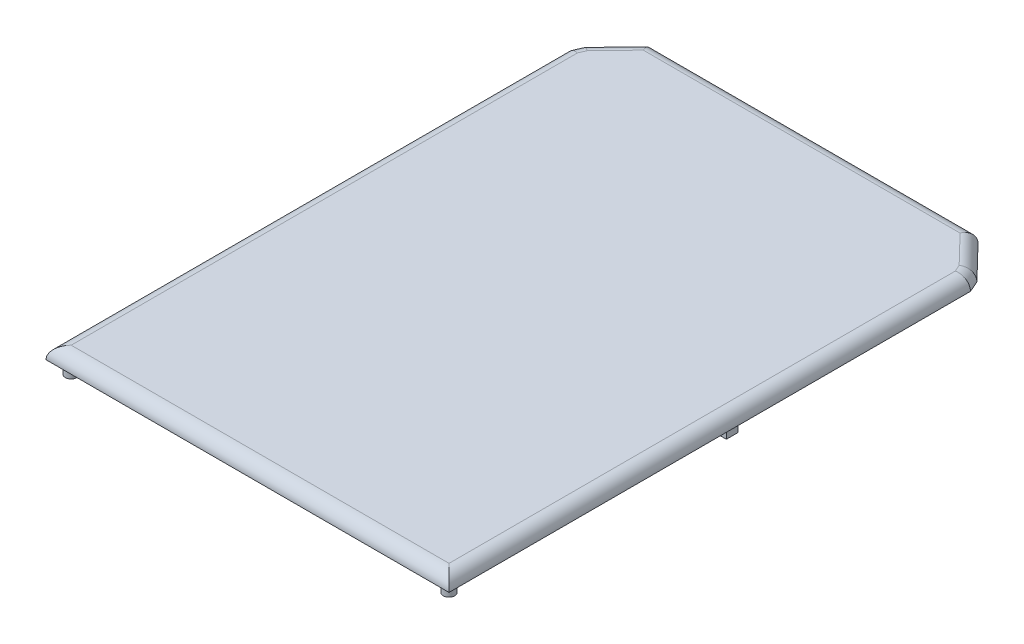
ISO-10303-21;
HEADER;
FILE_DESCRIPTION(('STEP AP214'),'2;1');
FILE_NAME('part.step','',(''),(''),'','','');
FILE_SCHEMA(('AUTOMOTIVE_DESIGN { 1 0 10303 214 1 1 1 1 }'));
ENDSEC;
DATA;
#1=APPLICATION_CONTEXT('core data for automotive mechanical design processes');
#2=APPLICATION_PROTOCOL_DEFINITION('international standard','automotive_design',2000,#1);
#3=PRODUCT_CONTEXT('',#1,'mechanical');
#4=PRODUCT('Part','Part','',(#3));
#5=PRODUCT_RELATED_PRODUCT_CATEGORY('part','',(#4));
#6=PRODUCT_DEFINITION_FORMATION('','',#4);
#7=PRODUCT_DEFINITION_CONTEXT('part definition',#1,'design');
#8=PRODUCT_DEFINITION('design','',#6,#7);
#9=PRODUCT_DEFINITION_SHAPE('','',#8);
#10=(LENGTH_UNIT() NAMED_UNIT(*) SI_UNIT(.MILLI.,.METRE.));
#11=(NAMED_UNIT(*) PLANE_ANGLE_UNIT() SI_UNIT($,.RADIAN.));
#12=(NAMED_UNIT(*) SI_UNIT($,.STERADIAN.) SOLID_ANGLE_UNIT());
#13=UNCERTAINTY_MEASURE_WITH_UNIT(LENGTH_MEASURE(1.E-05),#10,'distance_accuracy_value','');
#14=(GEOMETRIC_REPRESENTATION_CONTEXT(3) GLOBAL_UNCERTAINTY_ASSIGNED_CONTEXT((#13)) GLOBAL_UNIT_ASSIGNED_CONTEXT((#10,
#11,#12)) REPRESENTATION_CONTEXT('',''));
#15=CARTESIAN_POINT('',(0.,0.,0.));
#16=DIRECTION('',(0.,0.,1.));
#17=DIRECTION('',(1.,0.,0.));
#18=AXIS2_PLACEMENT_3D('',#15,#16,#17);
#19=CARTESIAN_POINT('',(0.,5.,0.));
#20=DIRECTION('',(0.,1.,0.));
#21=DIRECTION('',(0.,0.,1.));
#22=AXIS2_PLACEMENT_3D('',#19,#20,#21);
#23=PLANE('',#22);
#24=DIRECTION('',(-0.397835276280769,0.,0.917456861627076));
#25=VECTOR('',#24,1.);
#26=CARTESIAN_POINT('',(-75.4127156918646,5.,-30.0208236185962));
#27=LINE('',#26,#25);
#28=CARTESIAN_POINT('',(-73.8147089567304,5.,-33.7060228241099));
#29=VERTEX_POINT('',#28);
#30=CARTESIAN_POINT('',(-75.,5.,-30.9725965406513));
#31=VERTEX_POINT('',#30);
#32=EDGE_CURVE('E276',#29,#31,#27,.T.);
#33=ORIENTED_EDGE('',*,*,#32,.T.);
#34=DIRECTION('',(0.,0.,1.));
#35=VECTOR('',#34,1.);
#36=CARTESIAN_POINT('',(-75.,5.,175.));
#37=LINE('',#36,#35);
#38=CARTESIAN_POINT('',(-75.,5.,170.));
#39=VERTEX_POINT('',#38);
#40=EDGE_CURVE('E11',#31,#39,#37,.T.);
#41=ORIENTED_EDGE('',*,*,#40,.T.);
#42=DIRECTION('',(1.,0.,0.));
#43=VECTOR('',#42,1.);
#44=CARTESIAN_POINT('',(80.,5.,170.));
#45=LINE('',#44,#43);
#46=CARTESIAN_POINT('',(75.,5.,170.));
#47=VERTEX_POINT('',#46);
#48=EDGE_CURVE('E44',#39,#47,#45,.T.);
#49=ORIENTED_EDGE('',*,*,#48,.T.);
#50=DIRECTION('',(0.,0.,-1.));
#51=VECTOR('',#50,1.);
#52=CARTESIAN_POINT('',(75.,5.,-32.01));
#53=LINE('',#52,#51);
#54=CARTESIAN_POINT('',(75.,5.,-30.9725965406513));
#55=VERTEX_POINT('',#54);
#56=EDGE_CURVE('E266',#47,#55,#53,.T.);
#57=ORIENTED_EDGE('',*,*,#56,.T.);
#58=DIRECTION('',(-0.397835276280769,0.,-0.917456861627076));
#59=VECTOR('',#58,1.);
#60=CARTESIAN_POINT('',(73.4527156918646,5.,-34.5408236185962));
#61=LINE('',#60,#59);
#62=CARTESIAN_POINT('',(73.8147089567303,5.,-33.7060228241099));
#63=VERTEX_POINT('',#62);
#64=EDGE_CURVE('E268',#55,#63,#61,.T.);
#65=ORIENTED_EDGE('',*,*,#64,.T.);
#66=DIRECTION('',(-0.695545808825703,0.,-0.718481751908146));
#67=VECTOR('',#66,1.);
#68=CARTESIAN_POINT('',(61.4075912404593,5.,-46.5222709558715));
#69=LINE('',#68,#67);
#70=CARTESIAN_POINT('',(62.8812670581701,5.,-45.));
#71=VERTEX_POINT('',#70);
#72=EDGE_CURVE('E270',#63,#71,#69,.T.);
#73=ORIENTED_EDGE('',*,*,#72,.T.);
#74=DIRECTION('',(-1.,0.,0.));
#75=VECTOR('',#74,1.);
#76=CARTESIAN_POINT('',(-65.,5.,-45.));
#77=LINE('',#76,#75);
#78=CARTESIAN_POINT('',(-62.88126705817,5.,-45.));
#79=VERTEX_POINT('',#78);
#80=EDGE_CURVE('E272',#71,#79,#77,.T.);
#81=ORIENTED_EDGE('',*,*,#80,.T.);
#82=DIRECTION('',(-0.695545808825703,0.,0.718481751908146));
#83=VECTOR('',#82,1.);
#84=CARTESIAN_POINT('',(-74.4475912404593,5.,-33.0522709558715));
#85=LINE('',#84,#83);
#86=EDGE_CURVE('E274',#79,#29,#85,.T.);
#87=ORIENTED_EDGE('',*,*,#86,.T.);
#88=EDGE_LOOP('',(#33,#41,#49,#57,#65,#73,#81,#87));
#89=FACE_BOUND('',#88,.T.);
#90=ADVANCED_FACE('F35',(#89),#23,.T.);
#91=CARTESIAN_POINT('',(0.,0.,0.));
#92=DIRECTION('',(0.,1.,0.));
#93=DIRECTION('',(0.,0.,1.));
#94=AXIS2_PLACEMENT_3D('',#91,#92,#93);
#95=PLANE('',#94);
#96=DIRECTION('',(0.,0.,-1.));
#97=VECTOR('',#96,1.);
#98=CARTESIAN_POINT('',(77.4,0.,57.7));
#99=LINE('',#98,#97);
#100=CARTESIAN_POINT('',(77.4,0.,62.3));
#101=VERTEX_POINT('',#100);
#102=CARTESIAN_POINT('',(77.4,0.,57.7));
#103=VERTEX_POINT('',#102);
#104=EDGE_CURVE('E179',#101,#103,#99,.T.);
#105=ORIENTED_EDGE('',*,*,#104,.T.);
#106=DIRECTION('',(-1.,0.,0.));
#107=VECTOR('',#106,1.);
#108=CARTESIAN_POINT('',(75.1,0.,57.7));
#109=LINE('',#108,#107);
#110=CARTESIAN_POINT('',(75.1,0.,57.7));
#111=VERTEX_POINT('',#110);
#112=EDGE_CURVE('E161',#103,#111,#109,.T.);
#113=ORIENTED_EDGE('',*,*,#112,.T.);
#114=DIRECTION('',(0.,0.,1.));
#115=VECTOR('',#114,1.);
#116=CARTESIAN_POINT('',(75.1,0.,62.3));
#117=LINE('',#116,#115);
#118=CARTESIAN_POINT('',(75.1,0.,62.3));
#119=VERTEX_POINT('',#118);
#120=EDGE_CURVE('E176',#111,#119,#117,.T.);
#121=ORIENTED_EDGE('',*,*,#120,.T.);
#122=DIRECTION('',(1.,0.,0.));
#123=VECTOR('',#122,1.);
#124=CARTESIAN_POINT('',(77.4,0.,62.3));
#125=LINE('',#124,#123);
#126=EDGE_CURVE('E52',#119,#101,#125,.T.);
#127=ORIENTED_EDGE('',*,*,#126,.T.);
#128=EDGE_LOOP('',(#105,#113,#121,#127));
#129=FACE_BOUND('',#128,.T.);
#130=DIRECTION('',(0.,0.,-1.));
#131=VECTOR('',#130,1.);
#132=CARTESIAN_POINT('',(-75.1,0.,60.));
#133=LINE('',#132,#131);
#134=CARTESIAN_POINT('',(-75.1,0.,62.3));
#135=VERTEX_POINT('',#134);
#136=CARTESIAN_POINT('',(-75.1,0.,57.7));
#137=VERTEX_POINT('',#136);
#138=EDGE_CURVE('E193',#135,#137,#133,.T.);
#139=ORIENTED_EDGE('',*,*,#138,.T.);
#140=DIRECTION('',(-1.,0.,0.));
#141=VECTOR('',#140,1.);
#142=CARTESIAN_POINT('',(-75.1,0.,57.7));
#143=LINE('',#142,#141);
#144=CARTESIAN_POINT('',(-77.4,0.,57.7));
#145=VERTEX_POINT('',#144);
#146=EDGE_CURVE('E185',#137,#145,#143,.T.);
#147=ORIENTED_EDGE('',*,*,#146,.T.);
#148=DIRECTION('',(0.,0.,1.));
#149=VECTOR('',#148,1.);
#150=CARTESIAN_POINT('',(-77.4,0.,57.7));
#151=LINE('',#150,#149);
#152=CARTESIAN_POINT('',(-77.4,0.,62.3));
#153=VERTEX_POINT('',#152);
#154=EDGE_CURVE('E204',#145,#153,#151,.T.);
#155=ORIENTED_EDGE('',*,*,#154,.T.);
#156=DIRECTION('',(1.,0.,0.));
#157=VECTOR('',#156,1.);
#158=CARTESIAN_POINT('',(-77.4,0.,62.3));
#159=LINE('',#158,#157);
#160=EDGE_CURVE('E60',#153,#135,#159,.T.);
#161=ORIENTED_EDGE('',*,*,#160,.T.);
#162=EDGE_LOOP('',(#139,#147,#155,#161));
#163=FACE_BOUND('',#162,.T.);
#164=CARTESIAN_POINT('',(-75.,0.,170.));
#165=DIRECTION('',(0.,1.,0.));
#166=DIRECTION('',(0.,0.,1.));
#167=AXIS2_PLACEMENT_3D('',#164,#165,#166);
#168=CIRCLE('',#167,2.29999999999999);
#169=CARTESIAN_POINT('',(-75.,0.,172.3));
#170=VERTEX_POINT('',#169);
#171=EDGE_CURVE('E212',#170,#170,#168,.T.);
#172=ORIENTED_EDGE('',*,*,#171,.T.);
#173=EDGE_LOOP('',(#172));
#174=FACE_BOUND('',#173,.T.);
#175=CARTESIAN_POINT('',(75.,0.,170.));
#176=DIRECTION('',(0.,1.,0.));
#177=DIRECTION('',(0.,0.,1.));
#178=AXIS2_PLACEMENT_3D('',#175,#176,#177);
#179=CIRCLE('',#178,2.29999999999999);
#180=CARTESIAN_POINT('',(75.,0.,172.3));
#181=VERTEX_POINT('',#180);
#182=EDGE_CURVE('E221',#181,#181,#179,.T.);
#183=ORIENTED_EDGE('',*,*,#182,.T.);
#184=EDGE_LOOP('',(#183));
#185=FACE_BOUND('',#184,.T.);
#186=CARTESIAN_POINT('',(62.5,0.,-40.));
#187=DIRECTION('',(0.,1.,0.));
#188=DIRECTION('',(0.,0.,1.));
#189=AXIS2_PLACEMENT_3D('',#186,#187,#188);
#190=CIRCLE('',#189,2.29999999999999);
#191=CARTESIAN_POINT('',(62.5,0.,-37.7));
#192=VERTEX_POINT('',#191);
#193=EDGE_CURVE('E227',#192,#192,#190,.T.);
#194=ORIENTED_EDGE('',*,*,#193,.T.);
#195=EDGE_LOOP('',(#194));
#196=FACE_BOUND('',#195,.T.);
#197=CARTESIAN_POINT('',(-62.5,0.,-40.));
#198=DIRECTION('',(0.,1.,0.));
#199=DIRECTION('',(0.,0.,1.));
#200=AXIS2_PLACEMENT_3D('',#197,#198,#199);
#201=CIRCLE('',#200,2.3);
#202=CARTESIAN_POINT('',(-62.5,0.,-37.7));
#203=VERTEX_POINT('',#202);
#204=EDGE_CURVE('E233',#203,#203,#201,.T.);
#205=ORIENTED_EDGE('',*,*,#204,.T.);
#206=EDGE_LOOP('',(#205));
#207=FACE_BOUND('',#206,.T.);
#208=DIRECTION('',(1.,0.,0.));
#209=VECTOR('',#208,1.);
#210=CARTESIAN_POINT('',(-80.,0.,175.));
#211=LINE('',#210,#209);
#212=CARTESIAN_POINT('',(-80.,0.,175.));
#213=VERTEX_POINT('',#212);
#214=CARTESIAN_POINT('',(80.,0.,175.));
#215=VERTEX_POINT('',#214);
#216=EDGE_CURVE('E242',#213,#215,#211,.T.);
#217=ORIENTED_EDGE('',*,*,#216,.F.);
#218=DIRECTION('',(0.,0.,1.));
#219=VECTOR('',#218,1.);
#220=CARTESIAN_POINT('',(-80.,0.,-30.));
#221=LINE('',#220,#219);
#222=CARTESIAN_POINT('',(-80.,0.,-32.01));
#223=VERTEX_POINT('',#222);
#224=EDGE_CURVE('E263',#223,#213,#221,.T.);
#225=ORIENTED_EDGE('',*,*,#224,.F.);
#226=DIRECTION('',(-0.397835276280769,0.,0.917456861627076));
#227=VECTOR('',#226,1.);
#228=CARTESIAN_POINT('',(-78.04,0.,-36.53));
#229=LINE('',#228,#227);
#230=CARTESIAN_POINT('',(-78.04,0.,-36.53));
#231=VERTEX_POINT('',#230);
#232=EDGE_CURVE('E260',#231,#223,#229,.T.);
#233=ORIENTED_EDGE('',*,*,#232,.F.);
#234=DIRECTION('',(-0.695545808825703,0.,0.718481751908146));
#235=VECTOR('',#234,1.);
#236=CARTESIAN_POINT('',(-65.,0.,-50.));
#237=LINE('',#236,#235);
#238=CARTESIAN_POINT('',(-65.,0.,-50.));
#239=VERTEX_POINT('',#238);
#240=EDGE_CURVE('E257',#239,#231,#237,.T.);
#241=ORIENTED_EDGE('',*,*,#240,.F.);
#242=DIRECTION('',(-1.,0.,0.));
#243=VECTOR('',#242,1.);
#244=CARTESIAN_POINT('',(65.,0.,-50.));
#245=LINE('',#244,#243);
#246=CARTESIAN_POINT('',(65.,0.,-50.));
#247=VERTEX_POINT('',#246);
#248=EDGE_CURVE('E254',#247,#239,#245,.T.);
#249=ORIENTED_EDGE('',*,*,#248,.F.);
#250=DIRECTION('',(-0.695545808825703,0.,-0.718481751908146));
#251=VECTOR('',#250,1.);
#252=CARTESIAN_POINT('',(78.04,0.,-36.53));
#253=LINE('',#252,#251);
#254=CARTESIAN_POINT('',(78.04,0.,-36.53));
#255=VERTEX_POINT('',#254);
#256=EDGE_CURVE('E251',#255,#247,#253,.T.);
#257=ORIENTED_EDGE('',*,*,#256,.F.);
#258=DIRECTION('',(-0.397835276280769,0.,-0.917456861627076));
#259=VECTOR('',#258,1.);
#260=CARTESIAN_POINT('',(80.,0.,-32.01));
#261=LINE('',#260,#259);
#262=CARTESIAN_POINT('',(80.,0.,-32.01));
#263=VERTEX_POINT('',#262);
#264=EDGE_CURVE('E248',#263,#255,#261,.T.);
#265=ORIENTED_EDGE('',*,*,#264,.F.);
#266=DIRECTION('',(0.,0.,-1.));
#267=VECTOR('',#266,1.);
#268=CARTESIAN_POINT('',(80.,0.,-30.));
#269=LINE('',#268,#267);
#270=EDGE_CURVE('E245',#215,#263,#269,.T.);
#271=ORIENTED_EDGE('',*,*,#270,.F.);
#272=EDGE_LOOP('',(#217,#225,#233,#241,#249,#257,#265,#271));
#273=FACE_BOUND('',#272,.T.);
#274=ADVANCED_FACE('F309',(#129,#163,#174,#185,#196,#207,#273),#95,.F.);
#275=CARTESIAN_POINT('',(0.,0.,-45.));
#276=DIRECTION('',(1.,0.,0.));
#277=DIRECTION('',(0.,0.,-1.));
#278=AXIS2_PLACEMENT_3D('',#275,#276,#277);
#279=CYLINDRICAL_SURFACE('',#278,5.);
#280=CARTESIAN_POINT('',(62.8812670581701,0.,-45.));
#281=DIRECTION('',(0.920745841376898,0.,0.390162909035634));
#282=DIRECTION('',(-0.390162909035634,0.,0.920745841376898));
#283=AXIS2_PLACEMENT_3D('',#280,#281,#282);
#284=ELLIPSE('',#283,5.43038021493849,5.);
#285=EDGE_CURVE('E294',#247,#71,#284,.T.);
#286=ORIENTED_EDGE('',*,*,#285,.F.);
#287=ORIENTED_EDGE('',*,*,#248,.T.);
#288=CARTESIAN_POINT('',(-62.88126705817,0.,-45.));
#289=DIRECTION('',(0.920745841376898,0.,-0.390162909035634));
#290=DIRECTION('',(0.390162909035634,0.,0.920745841376898));
#291=AXIS2_PLACEMENT_3D('',#288,#289,#290);
#292=ELLIPSE('',#291,5.43038021493849,5.);
#293=EDGE_CURVE('E39',#79,#239,#292,.F.);
#294=ORIENTED_EDGE('',*,*,#293,.F.);
#295=ORIENTED_EDGE('',*,*,#80,.F.);
#296=EDGE_LOOP('',(#286,#287,#294,#295));
#297=FACE_BOUND('',#296,.T.);
#298=ADVANCED_FACE('F37',(#297),#279,.T.);
#299=CARTESIAN_POINT('',(-54.9484816119572,0.,-53.1943726963564));
#300=DIRECTION('',(0.695545808825703,0.,-0.718481751908146));
#301=DIRECTION('',(-0.718481751908146,0.,-0.695545808825703));
#302=AXIS2_PLACEMENT_3D('',#299,#300,#301);
#303=CYLINDRICAL_SURFACE('',#302,5.);
#304=ORIENTED_EDGE('',*,*,#293,.T.);
#305=ORIENTED_EDGE('',*,*,#240,.T.);
#306=CARTESIAN_POINT('',(-73.8147089567304,0.,-33.7060228241099));
#307=DIRECTION('',(0.555669256742774,0.,-0.831403438236175));
#308=DIRECTION('',(0.831403438236175,0.,0.555669256742773));
#309=AXIS2_PLACEMENT_3D('',#306,#307,#308);
#310=ELLIPSE('',#309,5.08211879930833,5.);
#311=EDGE_CURVE('E292',#29,#231,#310,.F.);
#312=ORIENTED_EDGE('',*,*,#311,.F.);
#313=ORIENTED_EDGE('',*,*,#86,.F.);
#314=EDGE_LOOP('',(#304,#305,#312,#313));
#315=FACE_BOUND('',#314,.T.);
#316=ADVANCED_FACE('F303',(#315),#303,.T.);
#317=CARTESIAN_POINT('',(54.9484816119572,0.,-53.1943726963564));
#318=DIRECTION('',(0.695545808825703,0.,0.718481751908146));
#319=DIRECTION('',(0.718481751908146,0.,-0.695545808825703));
#320=AXIS2_PLACEMENT_3D('',#317,#318,#319);
#321=CYLINDRICAL_SURFACE('',#320,5.);
#322=ORIENTED_EDGE('',*,*,#285,.T.);
#323=ORIENTED_EDGE('',*,*,#72,.F.);
#324=CARTESIAN_POINT('',(73.8147089567303,0.,-33.7060228241099));
#325=DIRECTION('',(0.555669256742774,0.,0.831403438236175));
#326=DIRECTION('',(-0.831403438236175,0.,0.555669256742773));
#327=AXIS2_PLACEMENT_3D('',#324,#325,#326);
#328=ELLIPSE('',#327,5.08211879930833,5.);
#329=EDGE_CURVE('E289',#255,#63,#328,.T.);
#330=ORIENTED_EDGE('',*,*,#329,.F.);
#331=ORIENTED_EDGE('',*,*,#256,.T.);
#332=EDGE_LOOP('',(#322,#323,#330,#331));
#333=FACE_BOUND('',#332,.T.);
#334=ADVANCED_FACE('F322',(#333),#321,.T.);
#335=CARTESIAN_POINT('',(-74.4344276233082,0.,-32.2768756950629));
#336=DIRECTION('',(0.397835276280769,0.,-0.917456861627076));
#337=DIRECTION('',(-0.917456861627076,0.,-0.397835276280769));
#338=AXIS2_PLACEMENT_3D('',#335,#336,#337);
#339=CYLINDRICAL_SURFACE('',#338,5.);
#340=ORIENTED_EDGE('',*,*,#311,.T.);
#341=ORIENTED_EDGE('',*,*,#232,.T.);
#342=CARTESIAN_POINT('',(-75.,0.,-30.9725965406513));
#343=DIRECTION('',(0.203154052842816,0.,-0.979146787163977));
#344=DIRECTION('',(-0.979146787163977,0.,-0.203154052842816));
#345=AXIS2_PLACEMENT_3D('',#342,#343,#344);
#346=ELLIPSE('',#345,5.10648665301973,5.);
#347=EDGE_CURVE('E286',#31,#223,#346,.F.);
#348=ORIENTED_EDGE('',*,*,#347,.F.);
#349=ORIENTED_EDGE('',*,*,#32,.F.);
#350=EDGE_LOOP('',(#340,#341,#348,#349));
#351=FACE_BOUND('',#350,.T.);
#352=ADVANCED_FACE('F313',(#351),#339,.T.);
#353=CARTESIAN_POINT('',(74.4344276233082,0.,-32.2768756950629));
#354=DIRECTION('',(0.397835276280769,0.,0.917456861627076));
#355=DIRECTION('',(0.917456861627076,0.,-0.397835276280769));
#356=AXIS2_PLACEMENT_3D('',#353,#354,#355);
#357=CYLINDRICAL_SURFACE('',#356,5.);
#358=ORIENTED_EDGE('',*,*,#329,.T.);
#359=ORIENTED_EDGE('',*,*,#64,.F.);
#360=CARTESIAN_POINT('',(75.,0.,-30.9725965406513));
#361=DIRECTION('',(0.203154052842816,0.,0.979146787163977));
#362=DIRECTION('',(-0.979146787163977,0.,0.203154052842816));
#363=AXIS2_PLACEMENT_3D('',#360,#361,#362);
#364=ELLIPSE('',#363,5.10648665301973,5.);
#365=EDGE_CURVE('E283',#263,#55,#364,.T.);
#366=ORIENTED_EDGE('',*,*,#365,.F.);
#367=ORIENTED_EDGE('',*,*,#264,.T.);
#368=EDGE_LOOP('',(#358,#359,#366,#367));
#369=FACE_BOUND('',#368,.T.);
#370=ADVANCED_FACE('F324',(#369),#357,.T.);
#371=CARTESIAN_POINT('',(-75.,0.,0.));
#372=DIRECTION('',(0.,0.,-1.));
#373=DIRECTION('',(-1.,0.,0.));
#374=AXIS2_PLACEMENT_3D('',#371,#372,#373);
#375=CYLINDRICAL_SURFACE('',#374,5.);
#376=ORIENTED_EDGE('',*,*,#347,.T.);
#377=ORIENTED_EDGE('',*,*,#224,.T.);
#378=CARTESIAN_POINT('',(-75.,0.,170.));
#379=DIRECTION('',(-0.707106781186547,0.,-0.707106781186547));
#380=DIRECTION('',(0.707106781186547,0.,-0.707106781186547));
#381=AXIS2_PLACEMENT_3D('',#378,#379,#380);
#382=ELLIPSE('',#381,7.07106781186547,5.);
#383=EDGE_CURVE('E281',#39,#213,#382,.F.);
#384=ORIENTED_EDGE('',*,*,#383,.F.);
#385=ORIENTED_EDGE('',*,*,#40,.F.);
#386=EDGE_LOOP('',(#376,#377,#384,#385));
#387=FACE_BOUND('',#386,.T.);
#388=ADVANCED_FACE('F317',(#387),#375,.T.);
#389=CARTESIAN_POINT('',(75.,0.,0.));
#390=DIRECTION('',(0.,0.,1.));
#391=DIRECTION('',(1.,0.,0.));
#392=AXIS2_PLACEMENT_3D('',#389,#390,#391);
#393=CYLINDRICAL_SURFACE('',#392,5.);
#394=ORIENTED_EDGE('',*,*,#365,.T.);
#395=ORIENTED_EDGE('',*,*,#56,.F.);
#396=CARTESIAN_POINT('',(75.,0.,170.));
#397=DIRECTION('',(-0.707106781186547,0.,0.707106781186547));
#398=DIRECTION('',(0.707106781186547,0.,0.707106781186547));
#399=AXIS2_PLACEMENT_3D('',#396,#397,#398);
#400=ELLIPSE('',#399,7.07106781186547,5.);
#401=EDGE_CURVE('E239',#215,#47,#400,.T.);
#402=ORIENTED_EDGE('',*,*,#401,.F.);
#403=ORIENTED_EDGE('',*,*,#270,.T.);
#404=EDGE_LOOP('',(#394,#395,#402,#403));
#405=FACE_BOUND('',#404,.T.);
#406=ADVANCED_FACE('F331',(#405),#393,.T.);
#407=CARTESIAN_POINT('',(0.,0.,170.));
#408=DIRECTION('',(-1.,0.,0.));
#409=DIRECTION('',(0.,0.,1.));
#410=AXIS2_PLACEMENT_3D('',#407,#408,#409);
#411=CYLINDRICAL_SURFACE('',#410,5.);
#412=ORIENTED_EDGE('',*,*,#383,.T.);
#413=ORIENTED_EDGE('',*,*,#216,.T.);
#414=ORIENTED_EDGE('',*,*,#401,.T.);
#415=ORIENTED_EDGE('',*,*,#48,.F.);
#416=EDGE_LOOP('',(#412,#413,#414,#415));
#417=FACE_BOUND('',#416,.T.);
#418=ADVANCED_FACE('F329',(#417),#411,.T.);
#419=CARTESIAN_POINT('',(-62.5,-5.,-40.));
#420=DIRECTION('',(0.,1.,0.));
#421=DIRECTION('',(0.,0.,1.));
#422=AXIS2_PLACEMENT_3D('',#419,#420,#421);
#423=CYLINDRICAL_SURFACE('',#422,2.3);
#424=CARTESIAN_POINT('',(-62.5,-5.,-40.));
#425=DIRECTION('',(0.,1.,0.));
#426=DIRECTION('',(0.,0.,1.));
#427=AXIS2_PLACEMENT_3D('',#424,#425,#426);
#428=CIRCLE('',#427,2.3);
#429=CARTESIAN_POINT('',(-62.5,-5.,-37.7));
#430=VERTEX_POINT('',#429);
#431=EDGE_CURVE('E236',#430,#430,#428,.T.);
#432=ORIENTED_EDGE('',*,*,#431,.T.);
#433=EDGE_LOOP('',(#432));
#434=FACE_BOUND('',#433,.T.);
#435=ORIENTED_EDGE('',*,*,#204,.F.);
#436=EDGE_LOOP('',(#435));
#437=FACE_BOUND('',#436,.T.);
#438=ADVANCED_FACE('F338',(#434,#437),#423,.T.);
#439=CARTESIAN_POINT('',(-62.5,-5.,-40.));
#440=DIRECTION('',(0.,1.,0.));
#441=DIRECTION('',(0.,0.,1.));
#442=AXIS2_PLACEMENT_3D('',#439,#440,#441);
#443=PLANE('',#442);
#444=ORIENTED_EDGE('',*,*,#431,.F.);
#445=EDGE_LOOP('',(#444));
#446=FACE_BOUND('',#445,.T.);
#447=ADVANCED_FACE('F351',(#446),#443,.F.);
#448=CARTESIAN_POINT('',(62.5,-5.,-40.));
#449=DIRECTION('',(0.,1.,0.));
#450=DIRECTION('',(0.,0.,1.));
#451=AXIS2_PLACEMENT_3D('',#448,#449,#450);
#452=CYLINDRICAL_SURFACE('',#451,2.29999999999999);
#453=CARTESIAN_POINT('',(62.5,-5.,-40.));
#454=DIRECTION('',(0.,1.,0.));
#455=DIRECTION('',(0.,0.,1.));
#456=AXIS2_PLACEMENT_3D('',#453,#454,#455);
#457=CIRCLE('',#456,2.29999999999999);
#458=CARTESIAN_POINT('',(62.5,-5.,-37.7));
#459=VERTEX_POINT('',#458);
#460=EDGE_CURVE('E230',#459,#459,#457,.T.);
#461=ORIENTED_EDGE('',*,*,#460,.T.);
#462=EDGE_LOOP('',(#461));
#463=FACE_BOUND('',#462,.T.);
#464=ORIENTED_EDGE('',*,*,#193,.F.);
#465=EDGE_LOOP('',(#464));
#466=FACE_BOUND('',#465,.T.);
#467=ADVANCED_FACE('F355',(#463,#466),#452,.T.);
#468=CARTESIAN_POINT('',(62.5,-5.,-40.));
#469=DIRECTION('',(0.,1.,0.));
#470=DIRECTION('',(0.,0.,1.));
#471=AXIS2_PLACEMENT_3D('',#468,#469,#470);
#472=PLANE('',#471);
#473=ORIENTED_EDGE('',*,*,#460,.F.);
#474=EDGE_LOOP('',(#473));
#475=FACE_BOUND('',#474,.T.);
#476=ADVANCED_FACE('F359',(#475),#472,.F.);
#477=CARTESIAN_POINT('',(75.,-5.,170.));
#478=DIRECTION('',(0.,1.,0.));
#479=DIRECTION('',(0.,0.,1.));
#480=AXIS2_PLACEMENT_3D('',#477,#478,#479);
#481=CYLINDRICAL_SURFACE('',#480,2.29999999999999);
#482=CARTESIAN_POINT('',(75.,-5.,170.));
#483=DIRECTION('',(0.,1.,0.));
#484=DIRECTION('',(0.,0.,1.));
#485=AXIS2_PLACEMENT_3D('',#482,#483,#484);
#486=CIRCLE('',#485,2.29999999999999);
#487=CARTESIAN_POINT('',(75.,-5.,172.3));
#488=VERTEX_POINT('',#487);
#489=EDGE_CURVE('E224',#488,#488,#486,.T.);
#490=ORIENTED_EDGE('',*,*,#489,.T.);
#491=EDGE_LOOP('',(#490));
#492=FACE_BOUND('',#491,.T.);
#493=ORIENTED_EDGE('',*,*,#182,.F.);
#494=EDGE_LOOP('',(#493));
#495=FACE_BOUND('',#494,.T.);
#496=ADVANCED_FACE('F363',(#492,#495),#481,.T.);
#497=CARTESIAN_POINT('',(75.,-5.,170.));
#498=DIRECTION('',(0.,1.,0.));
#499=DIRECTION('',(0.,0.,1.));
#500=AXIS2_PLACEMENT_3D('',#497,#498,#499);
#501=PLANE('',#500);
#502=ORIENTED_EDGE('',*,*,#489,.F.);
#503=EDGE_LOOP('',(#502));
#504=FACE_BOUND('',#503,.T.);
#505=ADVANCED_FACE('F367',(#504),#501,.F.);
#506=CARTESIAN_POINT('',(-75.,-5.,170.));
#507=DIRECTION('',(0.,1.,0.));
#508=DIRECTION('',(0.,0.,1.));
#509=AXIS2_PLACEMENT_3D('',#506,#507,#508);
#510=CYLINDRICAL_SURFACE('',#509,2.29999999999999);
#511=CARTESIAN_POINT('',(-75.,-5.,170.));
#512=DIRECTION('',(0.,1.,0.));
#513=DIRECTION('',(0.,0.,1.));
#514=AXIS2_PLACEMENT_3D('',#511,#512,#513);
#515=CIRCLE('',#514,2.29999999999999);
#516=CARTESIAN_POINT('',(-75.,-5.,172.3));
#517=VERTEX_POINT('',#516);
#518=EDGE_CURVE('E218',#517,#517,#515,.T.);
#519=ORIENTED_EDGE('',*,*,#518,.T.);
#520=EDGE_LOOP('',(#519));
#521=FACE_BOUND('',#520,.T.);
#522=ORIENTED_EDGE('',*,*,#171,.F.);
#523=EDGE_LOOP('',(#522));
#524=FACE_BOUND('',#523,.T.);
#525=ADVANCED_FACE('F371',(#521,#524),#510,.T.);
#526=CARTESIAN_POINT('',(-75.,-5.,170.));
#527=DIRECTION('',(0.,1.,0.));
#528=DIRECTION('',(0.,0.,1.));
#529=AXIS2_PLACEMENT_3D('',#526,#527,#528);
#530=PLANE('',#529);
#531=ORIENTED_EDGE('',*,*,#518,.F.);
#532=EDGE_LOOP('',(#531));
#533=FACE_BOUND('',#532,.T.);
#534=ADVANCED_FACE('F375',(#533),#530,.F.);
#535=CARTESIAN_POINT('',(-75.1,-5.,57.7));
#536=DIRECTION('',(0.,0.,-1.));
#537=DIRECTION('',(-1.,0.,0.));
#538=AXIS2_PLACEMENT_3D('',#535,#536,#537);
#539=PLANE('',#538);
#540=ORIENTED_EDGE('',*,*,#146,.F.);
#541=DIRECTION('',(0.,1.,0.));
#542=VECTOR('',#541,1.);
#543=CARTESIAN_POINT('',(-75.1,-5.,57.7));
#544=LINE('',#543,#542);
#545=CARTESIAN_POINT('',(-75.1,-5.,57.7));
#546=VERTEX_POINT('',#545);
#547=EDGE_CURVE('E210',#546,#137,#544,.T.);
#548=ORIENTED_EDGE('',*,*,#547,.F.);
#549=DIRECTION('',(-1.,0.,0.));
#550=VECTOR('',#549,1.);
#551=CARTESIAN_POINT('',(-75.1,-5.,57.7));
#552=LINE('',#551,#550);
#553=CARTESIAN_POINT('',(-77.4,-5.,57.7));
#554=VERTEX_POINT('',#553);
#555=EDGE_CURVE('E189',#546,#554,#552,.T.);
#556=ORIENTED_EDGE('',*,*,#555,.T.);
#557=DIRECTION('',(0.,1.,0.));
#558=VECTOR('',#557,1.);
#559=CARTESIAN_POINT('',(-77.4,-5.,57.7));
#560=LINE('',#559,#558);
#561=EDGE_CURVE('E201',#554,#145,#560,.T.);
#562=ORIENTED_EDGE('',*,*,#561,.T.);
#563=EDGE_LOOP('',(#540,#548,#556,#562));
#564=FACE_BOUND('',#563,.T.);
#565=ADVANCED_FACE('F379',(#564),#539,.T.);
#566=CARTESIAN_POINT('',(-75.1,-5.,60.));
#567=DIRECTION('',(1.,0.,0.));
#568=DIRECTION('',(0.,0.,-1.));
#569=AXIS2_PLACEMENT_3D('',#566,#567,#568);
#570=PLANE('',#569);
#571=ORIENTED_EDGE('',*,*,#138,.F.);
#572=DIRECTION('',(0.,1.,0.));
#573=VECTOR('',#572,1.);
#574=CARTESIAN_POINT('',(-75.1,-5.,62.3));
#575=LINE('',#574,#573);
#576=CARTESIAN_POINT('',(-75.1,-5.,62.3));
#577=VERTEX_POINT('',#576);
#578=EDGE_CURVE('E213',#577,#135,#575,.T.);
#579=ORIENTED_EDGE('',*,*,#578,.F.);
#580=DIRECTION('',(0.,0.,-1.));
#581=VECTOR('',#580,1.);
#582=CARTESIAN_POINT('',(-75.1,-5.,62.3));
#583=LINE('',#582,#581);
#584=EDGE_CURVE('E199',#577,#546,#583,.T.);
#585=ORIENTED_EDGE('',*,*,#584,.T.);
#586=ORIENTED_EDGE('',*,*,#547,.T.);
#587=EDGE_LOOP('',(#571,#579,#585,#586));
#588=FACE_BOUND('',#587,.T.);
#589=ADVANCED_FACE('F383',(#588),#570,.T.);
#590=CARTESIAN_POINT('',(-77.4,-5.,62.3));
#591=DIRECTION('',(0.,0.,1.));
#592=DIRECTION('',(1.,0.,0.));
#593=AXIS2_PLACEMENT_3D('',#590,#591,#592);
#594=PLANE('',#593);
#595=ORIENTED_EDGE('',*,*,#160,.F.);
#596=DIRECTION('',(0.,1.,0.));
#597=VECTOR('',#596,1.);
#598=CARTESIAN_POINT('',(-77.4,-5.,62.3));
#599=LINE('',#598,#597);
#600=CARTESIAN_POINT('',(-77.4,-5.,62.3));
#601=VERTEX_POINT('',#600);
#602=EDGE_CURVE('E215',#601,#153,#599,.T.);
#603=ORIENTED_EDGE('',*,*,#602,.F.);
#604=DIRECTION('',(1.,0.,0.));
#605=VECTOR('',#604,1.);
#606=CARTESIAN_POINT('',(-77.4,-5.,62.3));
#607=LINE('',#606,#605);
#608=EDGE_CURVE('E196',#601,#577,#607,.T.);
#609=ORIENTED_EDGE('',*,*,#608,.T.);
#610=ORIENTED_EDGE('',*,*,#578,.T.);
#611=EDGE_LOOP('',(#595,#603,#609,#610));
#612=FACE_BOUND('',#611,.T.);
#613=ADVANCED_FACE('F389',(#612),#594,.T.);
#614=CARTESIAN_POINT('',(-77.4,-5.,57.7));
#615=DIRECTION('',(-1.,0.,0.));
#616=DIRECTION('',(0.,0.,1.));
#617=AXIS2_PLACEMENT_3D('',#614,#615,#616);
#618=PLANE('',#617);
#619=ORIENTED_EDGE('',*,*,#154,.F.);
#620=ORIENTED_EDGE('',*,*,#561,.F.);
#621=DIRECTION('',(0.,0.,1.));
#622=VECTOR('',#621,1.);
#623=CARTESIAN_POINT('',(-77.4,-5.,57.7));
#624=LINE('',#623,#622);
#625=EDGE_CURVE('E192',#554,#601,#624,.T.);
#626=ORIENTED_EDGE('',*,*,#625,.T.);
#627=ORIENTED_EDGE('',*,*,#602,.T.);
#628=EDGE_LOOP('',(#619,#620,#626,#627));
#629=FACE_BOUND('',#628,.T.);
#630=ADVANCED_FACE('F385',(#629),#618,.T.);
#631=CARTESIAN_POINT('',(0.,-5.,0.));
#632=DIRECTION('',(0.,1.,0.));
#633=DIRECTION('',(0.,0.,1.));
#634=AXIS2_PLACEMENT_3D('',#631,#632,#633);
#635=PLANE('',#634);
#636=ORIENTED_EDGE('',*,*,#555,.F.);
#637=ORIENTED_EDGE('',*,*,#584,.F.);
#638=ORIENTED_EDGE('',*,*,#608,.F.);
#639=ORIENTED_EDGE('',*,*,#625,.F.);
#640=EDGE_LOOP('',(#636,#637,#638,#639));
#641=FACE_BOUND('',#640,.T.);
#642=ADVANCED_FACE('F388',(#641),#635,.F.);
#643=CARTESIAN_POINT('',(75.1,-5.,57.7));
#644=DIRECTION('',(0.,0.,-1.));
#645=DIRECTION('',(-1.,0.,0.));
#646=AXIS2_PLACEMENT_3D('',#643,#644,#645);
#647=PLANE('',#646);
#648=ORIENTED_EDGE('',*,*,#112,.F.);
#649=DIRECTION('',(0.,1.,0.));
#650=VECTOR('',#649,1.);
#651=CARTESIAN_POINT('',(77.4,-5.,57.7));
#652=LINE('',#651,#650);
#653=CARTESIAN_POINT('',(77.4,-5.,57.7));
#654=VERTEX_POINT('',#653);
#655=EDGE_CURVE('E186',#654,#103,#652,.T.);
#656=ORIENTED_EDGE('',*,*,#655,.F.);
#657=DIRECTION('',(-1.,0.,0.));
#658=VECTOR('',#657,1.);
#659=CARTESIAN_POINT('',(75.1,-5.,57.7));
#660=LINE('',#659,#658);
#661=CARTESIAN_POINT('',(75.1,-5.,57.7));
#662=VERTEX_POINT('',#661);
#663=EDGE_CURVE('E166',#654,#662,#660,.T.);
#664=ORIENTED_EDGE('',*,*,#663,.T.);
#665=DIRECTION('',(0.,1.,0.));
#666=VECTOR('',#665,1.);
#667=CARTESIAN_POINT('',(75.1,-5.,57.7));
#668=LINE('',#667,#666);
#669=EDGE_CURVE('E155',#662,#111,#668,.T.);
#670=ORIENTED_EDGE('',*,*,#669,.T.);
#671=EDGE_LOOP('',(#648,#656,#664,#670));
#672=FACE_BOUND('',#671,.T.);
#673=ADVANCED_FACE('F398',(#672),#647,.T.);
#674=CARTESIAN_POINT('',(77.4,-5.,57.7));
#675=DIRECTION('',(1.,0.,0.));
#676=DIRECTION('',(0.,0.,-1.));
#677=AXIS2_PLACEMENT_3D('',#674,#675,#676);
#678=PLANE('',#677);
#679=ORIENTED_EDGE('',*,*,#104,.F.);
#680=DIRECTION('',(0.,1.,0.));
#681=VECTOR('',#680,1.);
#682=CARTESIAN_POINT('',(77.4,-5.,62.3));
#683=LINE('',#682,#681);
#684=CARTESIAN_POINT('',(77.4,-5.,62.3));
#685=VERTEX_POINT('',#684);
#686=EDGE_CURVE('E165',#685,#101,#683,.T.);
#687=ORIENTED_EDGE('',*,*,#686,.F.);
#688=DIRECTION('',(0.,0.,-1.));
#689=VECTOR('',#688,1.);
#690=CARTESIAN_POINT('',(77.4,-5.,57.7));
#691=LINE('',#690,#689);
#692=EDGE_CURVE('E171',#685,#654,#691,.T.);
#693=ORIENTED_EDGE('',*,*,#692,.T.);
#694=ORIENTED_EDGE('',*,*,#655,.T.);
#695=EDGE_LOOP('',(#679,#687,#693,#694));
#696=FACE_BOUND('',#695,.T.);
#697=ADVANCED_FACE('F404',(#696),#678,.T.);
#698=CARTESIAN_POINT('',(77.4,-5.,62.3));
#699=DIRECTION('',(0.,0.,1.));
#700=DIRECTION('',(1.,0.,0.));
#701=AXIS2_PLACEMENT_3D('',#698,#699,#700);
#702=PLANE('',#701);
#703=ORIENTED_EDGE('',*,*,#126,.F.);
#704=DIRECTION('',(0.,1.,0.));
#705=VECTOR('',#704,1.);
#706=CARTESIAN_POINT('',(75.1,-5.,62.3));
#707=LINE('',#706,#705);
#708=CARTESIAN_POINT('',(75.1,-5.,62.3));
#709=VERTEX_POINT('',#708);
#710=EDGE_CURVE('E152',#709,#119,#707,.T.);
#711=ORIENTED_EDGE('',*,*,#710,.F.);
#712=DIRECTION('',(1.,0.,0.));
#713=VECTOR('',#712,1.);
#714=CARTESIAN_POINT('',(77.4,-5.,62.3));
#715=LINE('',#714,#713);
#716=EDGE_CURVE('E160',#709,#685,#715,.T.);
#717=ORIENTED_EDGE('',*,*,#716,.T.);
#718=ORIENTED_EDGE('',*,*,#686,.T.);
#719=EDGE_LOOP('',(#703,#711,#717,#718));
#720=FACE_BOUND('',#719,.T.);
#721=ADVANCED_FACE('F164',(#720),#702,.T.);
#722=CARTESIAN_POINT('',(75.1,-5.,62.3));
#723=DIRECTION('',(-1.,0.,0.));
#724=DIRECTION('',(0.,0.,1.));
#725=AXIS2_PLACEMENT_3D('',#722,#723,#724);
#726=PLANE('',#725);
#727=ORIENTED_EDGE('',*,*,#120,.F.);
#728=ORIENTED_EDGE('',*,*,#669,.F.);
#729=DIRECTION('',(0.,0.,1.));
#730=VECTOR('',#729,1.);
#731=CARTESIAN_POINT('',(75.1,-5.,60.));
#732=LINE('',#731,#730);
#733=EDGE_CURVE('E150',#662,#709,#732,.T.);
#734=ORIENTED_EDGE('',*,*,#733,.T.);
#735=ORIENTED_EDGE('',*,*,#710,.T.);
#736=EDGE_LOOP('',(#727,#728,#734,#735));
#737=FACE_BOUND('',#736,.T.);
#738=ADVANCED_FACE('F151',(#737),#726,.T.);
#739=CARTESIAN_POINT('',(0.,-5.,0.));
#740=DIRECTION('',(0.,-1.,0.));
#741=DIRECTION('',(0.,0.,-1.));
#742=AXIS2_PLACEMENT_3D('',#739,#740,#741);
#743=PLANE('',#742);
#744=ORIENTED_EDGE('',*,*,#733,.F.);
#745=ORIENTED_EDGE('',*,*,#663,.F.);
#746=ORIENTED_EDGE('',*,*,#692,.F.);
#747=ORIENTED_EDGE('',*,*,#716,.F.);
#748=EDGE_LOOP('',(#744,#745,#746,#747));
#749=FACE_BOUND('',#748,.T.);
#750=ADVANCED_FACE('F169',(#749),#743,.T.);
#751=CLOSED_SHELL('',(#90,#274,#298,#316,#334,#352,#370,#388,#406,#418,#438,#447,#467,#476,#496,
#505,#525,#534,#565,#589,#613,#630,#642,#673,#697,#721,#738,#750));
#752=MANIFOLD_SOLID_BREP('B2',#751);
#753=ADVANCED_BREP_SHAPE_REPRESENTATION('',(#18,#752),#14);
#754=SHAPE_DEFINITION_REPRESENTATION(#9,#753);
ENDSEC;
END-ISO-10303-21;
